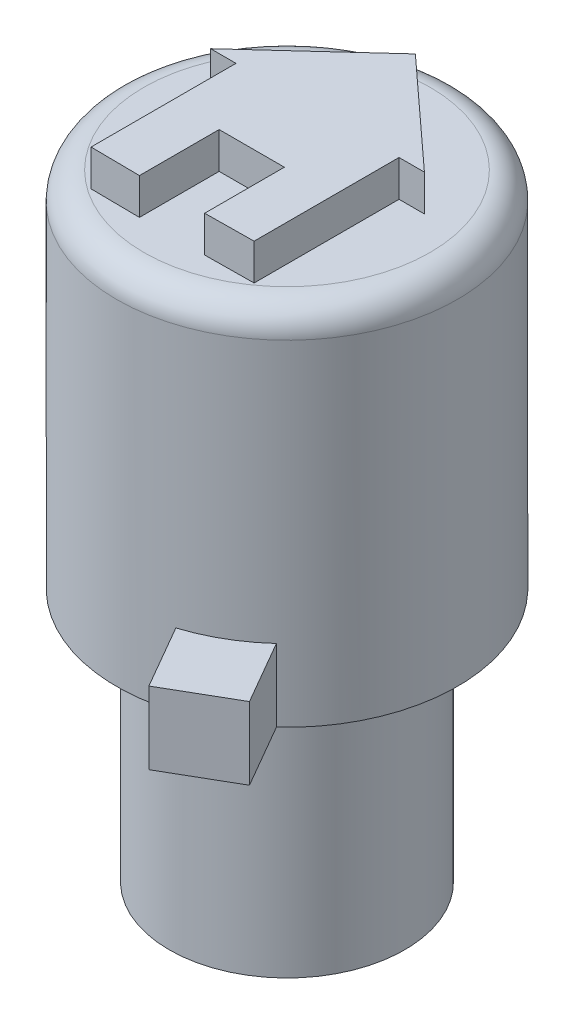
ISO-10303-21;
HEADER;
FILE_DESCRIPTION(('STEP AP214'),'2;1');
FILE_NAME('part.step','',(''),(''),'','','');
FILE_SCHEMA(('AUTOMOTIVE_DESIGN { 1 0 10303 214 1 1 1 1 }'));
ENDSEC;
DATA;
#1=APPLICATION_CONTEXT('core data for automotive mechanical design processes');
#2=APPLICATION_PROTOCOL_DEFINITION('international standard','automotive_design',2000,#1);
#3=PRODUCT_CONTEXT('',#1,'mechanical');
#4=PRODUCT('Part','Part','',(#3));
#5=PRODUCT_RELATED_PRODUCT_CATEGORY('part','',(#4));
#6=PRODUCT_DEFINITION_FORMATION('','',#4);
#7=PRODUCT_DEFINITION_CONTEXT('part definition',#1,'design');
#8=PRODUCT_DEFINITION('design','',#6,#7);
#9=PRODUCT_DEFINITION_SHAPE('','',#8);
#10=(LENGTH_UNIT() NAMED_UNIT(*) SI_UNIT(.MILLI.,.METRE.));
#11=(NAMED_UNIT(*) PLANE_ANGLE_UNIT() SI_UNIT($,.RADIAN.));
#12=(NAMED_UNIT(*) SI_UNIT($,.STERADIAN.) SOLID_ANGLE_UNIT());
#13=UNCERTAINTY_MEASURE_WITH_UNIT(LENGTH_MEASURE(1.E-05),#10,'distance_accuracy_value','');
#14=(GEOMETRIC_REPRESENTATION_CONTEXT(3) GLOBAL_UNCERTAINTY_ASSIGNED_CONTEXT((#13)) GLOBAL_UNIT_ASSIGNED_CONTEXT((#10,
#11,#12)) REPRESENTATION_CONTEXT('',''));
#15=CARTESIAN_POINT('',(0.,0.,0.));
#16=DIRECTION('',(0.,0.,1.));
#17=DIRECTION('',(1.,0.,0.));
#18=AXIS2_PLACEMENT_3D('',#15,#16,#17);
#19=CARTESIAN_POINT('',(0.,7.018,0.));
#20=DIRECTION('',(0.,-1.,0.));
#21=DIRECTION('',(0.,0.,-1.));
#22=AXIS2_PLACEMENT_3D('',#19,#20,#21);
#23=CYLINDRICAL_SURFACE('',#22,3.25);
#24=CARTESIAN_POINT('',(0.,7.018,0.));
#25=DIRECTION('',(0.,1.,0.));
#26=DIRECTION('',(0.,0.,1.));
#27=AXIS2_PLACEMENT_3D('',#24,#25,#26);
#28=CIRCLE('',#27,3.25);
#29=CARTESIAN_POINT('',(0.,7.018,3.25));
#30=VERTEX_POINT('',#29);
#31=EDGE_CURVE('E407',#30,#30,#28,.T.);
#32=ORIENTED_EDGE('',*,*,#31,.F.);
#33=EDGE_LOOP('',(#32));
#34=FACE_BOUND('',#33,.T.);
#35=CARTESIAN_POINT('',(0.,0.,0.));
#36=DIRECTION('',(0.,1.,0.));
#37=DIRECTION('',(0.,0.,1.));
#38=AXIS2_PLACEMENT_3D('',#35,#36,#37);
#39=CIRCLE('',#38,3.25);
#40=CARTESIAN_POINT('',(0.,0.,3.25));
#41=VERTEX_POINT('',#40);
#42=EDGE_CURVE('E411',#41,#41,#39,.T.);
#43=ORIENTED_EDGE('',*,*,#42,.T.);
#44=EDGE_LOOP('',(#43));
#45=FACE_BOUND('',#44,.T.);
#46=ADVANCED_FACE('F63',(#34,#45),#23,.T.);
#47=CARTESIAN_POINT('',(0.,0.,0.));
#48=DIRECTION('',(0.,1.,0.));
#49=DIRECTION('',(0.,0.,1.));
#50=AXIS2_PLACEMENT_3D('',#47,#48,#49);
#51=PLANE('',#50);
#52=ORIENTED_EDGE('',*,*,#42,.F.);
#53=EDGE_LOOP('',(#52));
#54=FACE_BOUND('',#53,.T.);
#55=ADVANCED_FACE('F439',(#54),#51,.F.);
#56=CARTESIAN_POINT('',(0.,17.018,0.));
#57=DIRECTION('',(0.,-1.,0.));
#58=DIRECTION('',(0.,0.,-1.));
#59=AXIS2_PLACEMENT_3D('',#56,#57,#58);
#60=CYLINDRICAL_SURFACE('',#59,4.7);
#61=CARTESIAN_POINT('',(0.,7.018,0.));
#62=DIRECTION('',(0.,1.,0.));
#63=DIRECTION('',(0.,0.,1.));
#64=AXIS2_PLACEMENT_3D('',#61,#62,#63);
#65=CIRCLE('',#64,4.7);
#66=CARTESIAN_POINT('',(3.17431768862556,7.018,3.46607951606406));
#67=VERTEX_POINT('',#66);
#68=CARTESIAN_POINT('',(-0.770430624962343,7.018,-4.63642498614182));
#69=VERTEX_POINT('',#68);
#70=EDGE_CURVE('E406',#67,#69,#65,.T.);
#71=ORIENTED_EDGE('',*,*,#70,.T.);
#72=DIRECTION('',(0.,-1.,0.));
#73=VECTOR('',#72,1.);
#74=CARTESIAN_POINT('',(-0.770430624962343,9.018,-4.63642498614182));
#75=LINE('',#74,#73);
#76=CARTESIAN_POINT('',(-0.770430624962343,9.018,-4.63642498614182));
#77=VERTEX_POINT('',#76);
#78=EDGE_CURVE('E79',#77,#69,#75,.T.);
#79=ORIENTED_EDGE('',*,*,#78,.F.);
#80=CARTESIAN_POINT('',(0.,9.018,0.));
#81=DIRECTION('',(0.,1.,0.));
#82=DIRECTION('',(0.,0.,-1.));
#83=AXIS2_PLACEMENT_3D('',#80,#81,#82);
#84=CIRCLE('',#83,4.7);
#85=CARTESIAN_POINT('',(-3.63004650825856,9.018,-2.98542498614181));
#86=VERTEX_POINT('',#85);
#87=EDGE_CURVE('E83',#77,#86,#84,.T.);
#88=ORIENTED_EDGE('',*,*,#87,.T.);
#89=DIRECTION('',(0.,-1.,0.));
#90=VECTOR('',#89,1.);
#91=CARTESIAN_POINT('',(-3.63004650825856,9.018,-2.98542498614181));
#92=LINE('',#91,#90);
#93=CARTESIAN_POINT('',(-3.63004650825856,7.018,-2.98542498614181));
#94=VERTEX_POINT('',#93);
#95=EDGE_CURVE('E207',#86,#94,#92,.T.);
#96=ORIENTED_EDGE('',*,*,#95,.T.);
#97=CARTESIAN_POINT('',(1.41455406813558,7.018,4.48207951606406));
#98=VERTEX_POINT('',#97);
#99=EDGE_CURVE('E403',#94,#98,#65,.T.);
#100=ORIENTED_EDGE('',*,*,#99,.T.);
#101=DIRECTION('',(0.,-1.,0.));
#102=VECTOR('',#101,1.);
#103=CARTESIAN_POINT('',(1.41455406813558,9.018,4.48207951606406));
#104=LINE('',#103,#102);
#105=CARTESIAN_POINT('',(1.41455406813558,9.018,4.48207951606406));
#106=VERTEX_POINT('',#105);
#107=EDGE_CURVE('E253',#106,#98,#104,.T.);
#108=ORIENTED_EDGE('',*,*,#107,.F.);
#109=CARTESIAN_POINT('',(0.,9.018,0.));
#110=DIRECTION('',(0.,1.,0.));
#111=DIRECTION('',(0.,0.,-1.));
#112=AXIS2_PLACEMENT_3D('',#109,#110,#111);
#113=CIRCLE('',#112,4.7);
#114=CARTESIAN_POINT('',(3.17431768862556,9.018,3.46607951606406));
#115=VERTEX_POINT('',#114);
#116=EDGE_CURVE('E262',#106,#115,#113,.T.);
#117=ORIENTED_EDGE('',*,*,#116,.T.);
#118=DIRECTION('',(0.,-1.,0.));
#119=VECTOR('',#118,1.);
#120=CARTESIAN_POINT('',(3.17431768862556,9.018,3.46607951606406));
#121=LINE('',#120,#119);
#122=EDGE_CURVE('E242',#115,#67,#121,.T.);
#123=ORIENTED_EDGE('',*,*,#122,.T.);
#124=EDGE_LOOP('',(#71,#79,#88,#96,#100,#108,#117,#123));
#125=FACE_BOUND('',#124,.T.);
#126=CARTESIAN_POINT('',(0.,16.268,0.));
#127=DIRECTION('',(0.,1.,0.));
#128=DIRECTION('',(0.,0.,1.));
#129=AXIS2_PLACEMENT_3D('',#126,#127,#128);
#130=CIRCLE('',#129,4.7);
#131=CARTESIAN_POINT('',(0.,16.268,4.7));
#132=VERTEX_POINT('',#131);
#133=EDGE_CURVE('E12',#132,#132,#130,.F.);
#134=ORIENTED_EDGE('',*,*,#133,.T.);
#135=EDGE_LOOP('',(#134));
#136=FACE_BOUND('',#135,.T.);
#137=ADVANCED_FACE('F444',(#125,#136),#60,.T.);
#138=CARTESIAN_POINT('',(0.,17.018,0.));
#139=DIRECTION('',(0.,1.,0.));
#140=DIRECTION('',(0.,0.,1.));
#141=AXIS2_PLACEMENT_3D('',#138,#139,#140);
#142=PLANE('',#141);
#143=CARTESIAN_POINT('',(0.,17.018,0.));
#144=DIRECTION('',(0.,1.,0.));
#145=DIRECTION('',(0.,0.,1.));
#146=AXIS2_PLACEMENT_3D('',#143,#144,#145);
#147=CIRCLE('',#146,3.95);
#148=CARTESIAN_POINT('',(0.,17.018,3.95));
#149=VERTEX_POINT('',#148);
#150=EDGE_CURVE('E72',#149,#149,#147,.T.);
#151=ORIENTED_EDGE('',*,*,#150,.T.);
#152=EDGE_LOOP('',(#151));
#153=FACE_BOUND('',#152,.T.);
#154=DIRECTION('',(-0.737672912354375,0.,-0.675158258765021));
#155=VECTOR('',#154,1.);
#156=CARTESIAN_POINT('',(2.95,17.018,-0.842487973796764));
#157=LINE('',#156,#155);
#158=CARTESIAN_POINT('',(2.95,17.018,-0.842487973796764));
#159=VERTEX_POINT('',#158);
#160=CARTESIAN_POINT('',(0.,17.018,-3.54248797379676));
#161=VERTEX_POINT('',#160);
#162=EDGE_CURVE('E237',#159,#161,#157,.T.);
#163=ORIENTED_EDGE('',*,*,#162,.F.);
#164=DIRECTION('',(1.,0.,0.));
#165=VECTOR('',#164,1.);
#166=CARTESIAN_POINT('',(2.25,17.018,-0.842487973796764));
#167=LINE('',#166,#165);
#168=CARTESIAN_POINT('',(2.25,17.018,-0.842487973796764));
#169=VERTEX_POINT('',#168);
#170=EDGE_CURVE('E287',#169,#159,#167,.T.);
#171=ORIENTED_EDGE('',*,*,#170,.F.);
#172=DIRECTION('',(0.,0.,-1.));
#173=VECTOR('',#172,1.);
#174=CARTESIAN_POINT('',(2.25,17.018,3.15751202620324));
#175=LINE('',#174,#173);
#176=CARTESIAN_POINT('',(2.25,17.018,3.15751202620324));
#177=VERTEX_POINT('',#176);
#178=EDGE_CURVE('E353',#177,#169,#175,.T.);
#179=ORIENTED_EDGE('',*,*,#178,.F.);
#180=DIRECTION('',(0.99993946534493,0.,-0.0110029834906805));
#181=VECTOR('',#180,1.);
#182=CARTESIAN_POINT('',(0.9,17.018,3.17236695315353));
#183=LINE('',#182,#181);
#184=CARTESIAN_POINT('',(0.9,17.018,3.17236695315353));
#185=VERTEX_POINT('',#184);
#186=EDGE_CURVE('E349',#185,#177,#183,.T.);
#187=ORIENTED_EDGE('',*,*,#186,.F.);
#188=DIRECTION('',(0.,0.,1.));
#189=VECTOR('',#188,1.);
#190=CARTESIAN_POINT('',(0.9,17.018,0.972366953153534));
#191=LINE('',#190,#189);
#192=CARTESIAN_POINT('',(0.9,17.018,0.972366953153534));
#193=VERTEX_POINT('',#192);
#194=EDGE_CURVE('E345',#193,#185,#191,.T.);
#195=ORIENTED_EDGE('',*,*,#194,.F.);
#196=DIRECTION('',(1.,0.,0.));
#197=VECTOR('',#196,1.);
#198=CARTESIAN_POINT('',(-0.9,17.018,0.972366953153534));
#199=LINE('',#198,#197);
#200=CARTESIAN_POINT('',(-0.9,17.018,0.972366953153534));
#201=VERTEX_POINT('',#200);
#202=EDGE_CURVE('E341',#201,#193,#199,.T.);
#203=ORIENTED_EDGE('',*,*,#202,.F.);
#204=DIRECTION('',(0.,0.,-1.));
#205=VECTOR('',#204,1.);
#206=CARTESIAN_POINT('',(-0.9,17.018,3.17236695315353));
#207=LINE('',#206,#205);
#208=CARTESIAN_POINT('',(-0.9,17.018,3.17236695315353));
#209=VERTEX_POINT('',#208);
#210=EDGE_CURVE('E337',#209,#201,#207,.T.);
#211=ORIENTED_EDGE('',*,*,#210,.F.);
#212=DIRECTION('',(0.99993946534493,0.,0.0110029834906805));
#213=VECTOR('',#212,1.);
#214=CARTESIAN_POINT('',(-2.25,17.018,3.15751202620324));
#215=LINE('',#214,#213);
#216=CARTESIAN_POINT('',(-2.25,17.018,3.15751202620324));
#217=VERTEX_POINT('',#216);
#218=EDGE_CURVE('E333',#217,#209,#215,.T.);
#219=ORIENTED_EDGE('',*,*,#218,.F.);
#220=DIRECTION('',(0.,0.,1.));
#221=VECTOR('',#220,1.);
#222=CARTESIAN_POINT('',(-2.25,17.018,-0.842487973796764));
#223=LINE('',#222,#221);
#224=CARTESIAN_POINT('',(-2.25,17.018,-0.842487973796764));
#225=VERTEX_POINT('',#224);
#226=EDGE_CURVE('E329',#225,#217,#223,.T.);
#227=ORIENTED_EDGE('',*,*,#226,.F.);
#228=DIRECTION('',(1.,0.,0.));
#229=VECTOR('',#228,1.);
#230=CARTESIAN_POINT('',(-2.95,17.018,-0.842487973796764));
#231=LINE('',#230,#229);
#232=CARTESIAN_POINT('',(-2.95,17.018,-0.842487973796764));
#233=VERTEX_POINT('',#232);
#234=EDGE_CURVE('E325',#233,#225,#231,.T.);
#235=ORIENTED_EDGE('',*,*,#234,.F.);
#236=DIRECTION('',(-0.737672912354375,0.,0.675158258765021));
#237=VECTOR('',#236,1.);
#238=CARTESIAN_POINT('',(0.,17.018,-3.54248797379676));
#239=LINE('',#238,#237);
#240=EDGE_CURVE('E321',#161,#233,#239,.T.);
#241=ORIENTED_EDGE('',*,*,#240,.F.);
#242=EDGE_LOOP('',(#163,#171,#179,#187,#195,#203,#211,#219,#227,#235,#241));
#243=FACE_BOUND('',#242,.T.);
#244=ADVANCED_FACE('F418',(#153,#243),#142,.T.);
#245=CARTESIAN_POINT('',(0.,7.018,0.));
#246=DIRECTION('',(0.,1.,0.));
#247=DIRECTION('',(0.,0.,1.));
#248=AXIS2_PLACEMENT_3D('',#245,#246,#247);
#249=PLANE('',#248);
#250=ORIENTED_EDGE('',*,*,#31,.T.);
#251=EDGE_LOOP('',(#250));
#252=FACE_BOUND('',#251,.T.);
#253=ORIENTED_EDGE('',*,*,#70,.F.);
#254=DIRECTION('',(0.500000000000001,0.,0.866025403784438));
#255=VECTOR('',#254,1.);
#256=CARTESIAN_POINT('',(3.17431768862556,7.018,3.46607951606406));
#257=LINE('',#256,#255);
#258=CARTESIAN_POINT('',(4.19031768862556,7.018,5.22584313655404));
#259=VERTEX_POINT('',#258);
#260=EDGE_CURVE('E229',#67,#259,#257,.T.);
#261=ORIENTED_EDGE('',*,*,#260,.T.);
#262=DIRECTION('',(-0.866025403784438,0.,0.500000000000001));
#263=VECTOR('',#262,1.);
#264=CARTESIAN_POINT('',(4.19031768862556,7.018,5.22584313655404));
#265=LINE('',#264,#263);
#266=CARTESIAN_POINT('',(2.43055406813558,7.018,6.24184313655404));
#267=VERTEX_POINT('',#266);
#268=EDGE_CURVE('E261',#259,#267,#265,.T.);
#269=ORIENTED_EDGE('',*,*,#268,.T.);
#270=DIRECTION('',(-0.500000000000001,0.,-0.866025403784438));
#271=VECTOR('',#270,1.);
#272=CARTESIAN_POINT('',(2.43055406813558,7.018,6.24184313655404));
#273=LINE('',#272,#271);
#274=EDGE_CURVE('E257',#267,#98,#273,.T.);
#275=ORIENTED_EDGE('',*,*,#274,.T.);
#276=ORIENTED_EDGE('',*,*,#99,.F.);
#277=DIRECTION('',(-0.500000000000001,0.,-0.866025403784438));
#278=VECTOR('',#277,1.);
#279=CARTESIAN_POINT('',(-4.64604650825856,7.018,-4.74518860663179));
#280=LINE('',#279,#278);
#281=CARTESIAN_POINT('',(-4.64604650825856,7.018,-4.74518860663179));
#282=VERTEX_POINT('',#281);
#283=EDGE_CURVE('E226',#94,#282,#280,.T.);
#284=ORIENTED_EDGE('',*,*,#283,.T.);
#285=DIRECTION('',(0.866025403784438,0.,-0.500000000000001));
#286=VECTOR('',#285,1.);
#287=CARTESIAN_POINT('',(-1.78643062496234,7.018,-6.39618860663179));
#288=LINE('',#287,#286);
#289=CARTESIAN_POINT('',(-1.78643062496234,7.018,-6.39618860663179));
#290=VERTEX_POINT('',#289);
#291=EDGE_CURVE('E200',#282,#290,#288,.T.);
#292=ORIENTED_EDGE('',*,*,#291,.T.);
#293=DIRECTION('',(0.500000000000001,0.,0.866025403784438));
#294=VECTOR('',#293,1.);
#295=CARTESIAN_POINT('',(-0.770430624962343,7.018,-4.63642498614182));
#296=LINE('',#295,#294);
#297=EDGE_CURVE('E221',#290,#69,#296,.T.);
#298=ORIENTED_EDGE('',*,*,#297,.T.);
#299=EDGE_LOOP('',(#253,#261,#269,#275,#276,#284,#292,#298));
#300=FACE_BOUND('',#299,.T.);
#301=ADVANCED_FACE('F451',(#252,#300),#249,.F.);
#302=CARTESIAN_POINT('',(2.95,18.018,-0.842487973796764));
#303=DIRECTION('',(-0.675158258765021,0.,0.737672912354375));
#304=DIRECTION('',(0.737672912354375,0.,0.675158258765021));
#305=AXIS2_PLACEMENT_3D('',#302,#303,#304);
#306=PLANE('',#305);
#307=ORIENTED_EDGE('',*,*,#162,.T.);
#308=DIRECTION('',(0.,-1.,0.));
#309=VECTOR('',#308,1.);
#310=CARTESIAN_POINT('',(0.,18.018,-3.54248797379676));
#311=LINE('',#310,#309);
#312=CARTESIAN_POINT('',(0.,18.018,-3.54248797379676));
#313=VERTEX_POINT('',#312);
#314=EDGE_CURVE('E399',#313,#161,#311,.T.);
#315=ORIENTED_EDGE('',*,*,#314,.F.);
#316=DIRECTION('',(-0.737672912354375,0.,-0.675158258765021));
#317=VECTOR('',#316,1.);
#318=CARTESIAN_POINT('',(2.95,18.018,-0.842487973796764));
#319=LINE('',#318,#317);
#320=CARTESIAN_POINT('',(2.95,18.018,-0.842487973796764));
#321=VERTEX_POINT('',#320);
#322=EDGE_CURVE('E282',#321,#313,#319,.T.);
#323=ORIENTED_EDGE('',*,*,#322,.F.);
#324=DIRECTION('',(0.,-1.,0.));
#325=VECTOR('',#324,1.);
#326=CARTESIAN_POINT('',(2.95,18.018,-0.842487973796764));
#327=LINE('',#326,#325);
#328=EDGE_CURVE('E317',#321,#159,#327,.T.);
#329=ORIENTED_EDGE('',*,*,#328,.T.);
#330=EDGE_LOOP('',(#307,#315,#323,#329));
#331=FACE_BOUND('',#330,.T.);
#332=ADVANCED_FACE('F454',(#331),#306,.F.);
#333=CARTESIAN_POINT('',(0.,18.018,-3.54248797379676));
#334=DIRECTION('',(0.675158258765021,0.,0.737672912354375));
#335=DIRECTION('',(0.737672912354375,0.,-0.675158258765021));
#336=AXIS2_PLACEMENT_3D('',#333,#334,#335);
#337=PLANE('',#336);
#338=ORIENTED_EDGE('',*,*,#240,.T.);
#339=DIRECTION('',(0.,-1.,0.));
#340=VECTOR('',#339,1.);
#341=CARTESIAN_POINT('',(-2.95,18.018,-0.842487973796764));
#342=LINE('',#341,#340);
#343=CARTESIAN_POINT('',(-2.95,18.018,-0.842487973796764));
#344=VERTEX_POINT('',#343);
#345=EDGE_CURVE('E395',#344,#233,#342,.T.);
#346=ORIENTED_EDGE('',*,*,#345,.F.);
#347=DIRECTION('',(-0.737672912354375,0.,0.675158258765021));
#348=VECTOR('',#347,1.);
#349=CARTESIAN_POINT('',(0.,18.018,-3.54248797379676));
#350=LINE('',#349,#348);
#351=EDGE_CURVE('E286',#313,#344,#350,.T.);
#352=ORIENTED_EDGE('',*,*,#351,.F.);
#353=ORIENTED_EDGE('',*,*,#314,.T.);
#354=EDGE_LOOP('',(#338,#346,#352,#353));
#355=FACE_BOUND('',#354,.T.);
#356=ADVANCED_FACE('F459',(#355),#337,.F.);
#357=CARTESIAN_POINT('',(-2.95,18.018,-0.842487973796764));
#358=DIRECTION('',(0.,0.,-1.));
#359=DIRECTION('',(-1.,0.,0.));
#360=AXIS2_PLACEMENT_3D('',#357,#358,#359);
#361=PLANE('',#360);
#362=ORIENTED_EDGE('',*,*,#234,.T.);
#363=DIRECTION('',(0.,-1.,0.));
#364=VECTOR('',#363,1.);
#365=CARTESIAN_POINT('',(-2.25,18.018,-0.842487973796764));
#366=LINE('',#365,#364);
#367=CARTESIAN_POINT('',(-2.25,18.018,-0.842487973796764));
#368=VERTEX_POINT('',#367);
#369=EDGE_CURVE('E391',#368,#225,#366,.T.);
#370=ORIENTED_EDGE('',*,*,#369,.F.);
#371=DIRECTION('',(1.,0.,0.));
#372=VECTOR('',#371,1.);
#373=CARTESIAN_POINT('',(-2.95,18.018,-0.842487973796764));
#374=LINE('',#373,#372);
#375=EDGE_CURVE('E290',#344,#368,#374,.T.);
#376=ORIENTED_EDGE('',*,*,#375,.F.);
#377=ORIENTED_EDGE('',*,*,#345,.T.);
#378=EDGE_LOOP('',(#362,#370,#376,#377));
#379=FACE_BOUND('',#378,.T.);
#380=ADVANCED_FACE('F463',(#379),#361,.F.);
#381=CARTESIAN_POINT('',(-2.25,18.018,-0.842487973796764));
#382=DIRECTION('',(1.,0.,0.));
#383=DIRECTION('',(0.,0.,-1.));
#384=AXIS2_PLACEMENT_3D('',#381,#382,#383);
#385=PLANE('',#384);
#386=ORIENTED_EDGE('',*,*,#226,.T.);
#387=DIRECTION('',(0.,-1.,0.));
#388=VECTOR('',#387,1.);
#389=CARTESIAN_POINT('',(-2.25,18.018,3.15751202620324));
#390=LINE('',#389,#388);
#391=CARTESIAN_POINT('',(-2.25,18.018,3.15751202620324));
#392=VERTEX_POINT('',#391);
#393=EDGE_CURVE('E387',#392,#217,#390,.T.);
#394=ORIENTED_EDGE('',*,*,#393,.F.);
#395=DIRECTION('',(0.,0.,1.));
#396=VECTOR('',#395,1.);
#397=CARTESIAN_POINT('',(-2.25,18.018,-0.842487973796764));
#398=LINE('',#397,#396);
#399=EDGE_CURVE('E293',#368,#392,#398,.T.);
#400=ORIENTED_EDGE('',*,*,#399,.F.);
#401=ORIENTED_EDGE('',*,*,#369,.T.);
#402=EDGE_LOOP('',(#386,#394,#400,#401));
#403=FACE_BOUND('',#402,.T.);
#404=ADVANCED_FACE('F467',(#403),#385,.F.);
#405=CARTESIAN_POINT('',(-2.25,18.018,3.15751202620324));
#406=DIRECTION('',(0.0110029834906805,0.,-0.99993946534493));
#407=DIRECTION('',(-0.99993946534493,0.,-0.0110029834906805));
#408=AXIS2_PLACEMENT_3D('',#405,#406,#407);
#409=PLANE('',#408);
#410=ORIENTED_EDGE('',*,*,#218,.T.);
#411=DIRECTION('',(0.,-1.,0.));
#412=VECTOR('',#411,1.);
#413=CARTESIAN_POINT('',(-0.9,18.018,3.17236695315353));
#414=LINE('',#413,#412);
#415=CARTESIAN_POINT('',(-0.9,18.018,3.17236695315353));
#416=VERTEX_POINT('',#415);
#417=EDGE_CURVE('E383',#416,#209,#414,.T.);
#418=ORIENTED_EDGE('',*,*,#417,.F.);
#419=DIRECTION('',(0.99993946534493,0.,0.0110029834906805));
#420=VECTOR('',#419,1.);
#421=CARTESIAN_POINT('',(-2.25,18.018,3.15751202620324));
#422=LINE('',#421,#420);
#423=EDGE_CURVE('E296',#392,#416,#422,.T.);
#424=ORIENTED_EDGE('',*,*,#423,.F.);
#425=ORIENTED_EDGE('',*,*,#393,.T.);
#426=EDGE_LOOP('',(#410,#418,#424,#425));
#427=FACE_BOUND('',#426,.T.);
#428=ADVANCED_FACE('F471',(#427),#409,.F.);
#429=CARTESIAN_POINT('',(-0.9,18.018,3.17236695315353));
#430=DIRECTION('',(-1.,0.,0.));
#431=DIRECTION('',(0.,0.,1.));
#432=AXIS2_PLACEMENT_3D('',#429,#430,#431);
#433=PLANE('',#432);
#434=ORIENTED_EDGE('',*,*,#210,.T.);
#435=DIRECTION('',(0.,-1.,0.));
#436=VECTOR('',#435,1.);
#437=CARTESIAN_POINT('',(-0.9,18.018,0.972366953153534));
#438=LINE('',#437,#436);
#439=CARTESIAN_POINT('',(-0.9,18.018,0.972366953153534));
#440=VERTEX_POINT('',#439);
#441=EDGE_CURVE('E379',#440,#201,#438,.T.);
#442=ORIENTED_EDGE('',*,*,#441,.F.);
#443=DIRECTION('',(0.,0.,-1.));
#444=VECTOR('',#443,1.);
#445=CARTESIAN_POINT('',(-0.9,18.018,3.17236695315353));
#446=LINE('',#445,#444);
#447=EDGE_CURVE('E299',#416,#440,#446,.T.);
#448=ORIENTED_EDGE('',*,*,#447,.F.);
#449=ORIENTED_EDGE('',*,*,#417,.T.);
#450=EDGE_LOOP('',(#434,#442,#448,#449));
#451=FACE_BOUND('',#450,.T.);
#452=ADVANCED_FACE('F475',(#451),#433,.F.);
#453=CARTESIAN_POINT('',(-0.9,18.018,0.972366953153534));
#454=DIRECTION('',(0.,0.,-1.));
#455=DIRECTION('',(-1.,0.,0.));
#456=AXIS2_PLACEMENT_3D('',#453,#454,#455);
#457=PLANE('',#456);
#458=ORIENTED_EDGE('',*,*,#202,.T.);
#459=DIRECTION('',(0.,-1.,0.));
#460=VECTOR('',#459,1.);
#461=CARTESIAN_POINT('',(0.9,18.018,0.972366953153534));
#462=LINE('',#461,#460);
#463=CARTESIAN_POINT('',(0.9,18.018,0.972366953153534));
#464=VERTEX_POINT('',#463);
#465=EDGE_CURVE('E375',#464,#193,#462,.T.);
#466=ORIENTED_EDGE('',*,*,#465,.F.);
#467=DIRECTION('',(1.,0.,0.));
#468=VECTOR('',#467,1.);
#469=CARTESIAN_POINT('',(-0.9,18.018,0.972366953153534));
#470=LINE('',#469,#468);
#471=EDGE_CURVE('E302',#440,#464,#470,.T.);
#472=ORIENTED_EDGE('',*,*,#471,.F.);
#473=ORIENTED_EDGE('',*,*,#441,.T.);
#474=EDGE_LOOP('',(#458,#466,#472,#473));
#475=FACE_BOUND('',#474,.T.);
#476=ADVANCED_FACE('F479',(#475),#457,.F.);
#477=CARTESIAN_POINT('',(0.9,18.018,0.972366953153534));
#478=DIRECTION('',(1.,0.,0.));
#479=DIRECTION('',(0.,0.,-1.));
#480=AXIS2_PLACEMENT_3D('',#477,#478,#479);
#481=PLANE('',#480);
#482=ORIENTED_EDGE('',*,*,#194,.T.);
#483=DIRECTION('',(0.,-1.,0.));
#484=VECTOR('',#483,1.);
#485=CARTESIAN_POINT('',(0.9,18.018,3.17236695315353));
#486=LINE('',#485,#484);
#487=CARTESIAN_POINT('',(0.9,18.018,3.17236695315353));
#488=VERTEX_POINT('',#487);
#489=EDGE_CURVE('E371',#488,#185,#486,.T.);
#490=ORIENTED_EDGE('',*,*,#489,.F.);
#491=DIRECTION('',(0.,0.,1.));
#492=VECTOR('',#491,1.);
#493=CARTESIAN_POINT('',(0.9,18.018,0.972366953153534));
#494=LINE('',#493,#492);
#495=EDGE_CURVE('E305',#464,#488,#494,.T.);
#496=ORIENTED_EDGE('',*,*,#495,.F.);
#497=ORIENTED_EDGE('',*,*,#465,.T.);
#498=EDGE_LOOP('',(#482,#490,#496,#497));
#499=FACE_BOUND('',#498,.T.);
#500=ADVANCED_FACE('F483',(#499),#481,.F.);
#501=CARTESIAN_POINT('',(0.9,18.018,3.17236695315353));
#502=DIRECTION('',(-0.0110029834906805,0.,-0.99993946534493));
#503=DIRECTION('',(-0.99993946534493,0.,0.0110029834906805));
#504=AXIS2_PLACEMENT_3D('',#501,#502,#503);
#505=PLANE('',#504);
#506=ORIENTED_EDGE('',*,*,#186,.T.);
#507=DIRECTION('',(0.,-1.,0.));
#508=VECTOR('',#507,1.);
#509=CARTESIAN_POINT('',(2.25,18.018,3.15751202620324));
#510=LINE('',#509,#508);
#511=CARTESIAN_POINT('',(2.25,18.018,3.15751202620324));
#512=VERTEX_POINT('',#511);
#513=EDGE_CURVE('E367',#512,#177,#510,.T.);
#514=ORIENTED_EDGE('',*,*,#513,.F.);
#515=DIRECTION('',(0.99993946534493,0.,-0.0110029834906805));
#516=VECTOR('',#515,1.);
#517=CARTESIAN_POINT('',(0.9,18.018,3.17236695315353));
#518=LINE('',#517,#516);
#519=EDGE_CURVE('E308',#488,#512,#518,.T.);
#520=ORIENTED_EDGE('',*,*,#519,.F.);
#521=ORIENTED_EDGE('',*,*,#489,.T.);
#522=EDGE_LOOP('',(#506,#514,#520,#521));
#523=FACE_BOUND('',#522,.T.);
#524=ADVANCED_FACE('F487',(#523),#505,.F.);
#525=CARTESIAN_POINT('',(2.25,18.018,3.15751202620324));
#526=DIRECTION('',(-1.,0.,0.));
#527=DIRECTION('',(0.,0.,1.));
#528=AXIS2_PLACEMENT_3D('',#525,#526,#527);
#529=PLANE('',#528);
#530=ORIENTED_EDGE('',*,*,#178,.T.);
#531=DIRECTION('',(0.,-1.,0.));
#532=VECTOR('',#531,1.);
#533=CARTESIAN_POINT('',(2.25,18.018,-0.842487973796764));
#534=LINE('',#533,#532);
#535=CARTESIAN_POINT('',(2.25,18.018,-0.842487973796764));
#536=VERTEX_POINT('',#535);
#537=EDGE_CURVE('E363',#536,#169,#534,.T.);
#538=ORIENTED_EDGE('',*,*,#537,.F.);
#539=DIRECTION('',(0.,0.,-1.));
#540=VECTOR('',#539,1.);
#541=CARTESIAN_POINT('',(2.25,18.018,3.15751202620324));
#542=LINE('',#541,#540);
#543=EDGE_CURVE('E311',#512,#536,#542,.T.);
#544=ORIENTED_EDGE('',*,*,#543,.F.);
#545=ORIENTED_EDGE('',*,*,#513,.T.);
#546=EDGE_LOOP('',(#530,#538,#544,#545));
#547=FACE_BOUND('',#546,.T.);
#548=ADVANCED_FACE('F491',(#547),#529,.F.);
#549=CARTESIAN_POINT('',(2.25,18.018,-0.842487973796764));
#550=DIRECTION('',(0.,0.,-1.));
#551=DIRECTION('',(-1.,0.,0.));
#552=AXIS2_PLACEMENT_3D('',#549,#550,#551);
#553=PLANE('',#552);
#554=ORIENTED_EDGE('',*,*,#170,.T.);
#555=ORIENTED_EDGE('',*,*,#328,.F.);
#556=DIRECTION('',(1.,0.,0.));
#557=VECTOR('',#556,1.);
#558=CARTESIAN_POINT('',(2.25,18.018,-0.842487973796764));
#559=LINE('',#558,#557);
#560=EDGE_CURVE('E314',#536,#321,#559,.T.);
#561=ORIENTED_EDGE('',*,*,#560,.F.);
#562=ORIENTED_EDGE('',*,*,#537,.T.);
#563=EDGE_LOOP('',(#554,#555,#561,#562));
#564=FACE_BOUND('',#563,.T.);
#565=ADVANCED_FACE('F434',(#564),#553,.F.);
#566=CARTESIAN_POINT('',(0.,18.018,0.));
#567=DIRECTION('',(0.,1.,0.));
#568=DIRECTION('',(0.,0.,1.));
#569=AXIS2_PLACEMENT_3D('',#566,#567,#568);
#570=PLANE('',#569);
#571=ORIENTED_EDGE('',*,*,#322,.T.);
#572=ORIENTED_EDGE('',*,*,#351,.T.);
#573=ORIENTED_EDGE('',*,*,#375,.T.);
#574=ORIENTED_EDGE('',*,*,#399,.T.);
#575=ORIENTED_EDGE('',*,*,#423,.T.);
#576=ORIENTED_EDGE('',*,*,#447,.T.);
#577=ORIENTED_EDGE('',*,*,#471,.T.);
#578=ORIENTED_EDGE('',*,*,#495,.T.);
#579=ORIENTED_EDGE('',*,*,#519,.T.);
#580=ORIENTED_EDGE('',*,*,#543,.T.);
#581=ORIENTED_EDGE('',*,*,#560,.T.);
#582=EDGE_LOOP('',(#571,#572,#573,#574,#575,#576,#577,#578,#579,#580,#581));
#583=FACE_BOUND('',#582,.T.);
#584=ADVANCED_FACE('F423',(#583),#570,.T.);
#585=CARTESIAN_POINT('',(0.,16.268,0.));
#586=DIRECTION('',(0.,1.,0.));
#587=DIRECTION('',(0.,0.,1.));
#588=AXIS2_PLACEMENT_3D('',#585,#586,#587);
#589=TOROIDAL_SURFACE('',#588,3.95,0.75);
#590=ORIENTED_EDGE('',*,*,#133,.F.);
#591=EDGE_LOOP('',(#590));
#592=FACE_BOUND('',#591,.T.);
#593=ORIENTED_EDGE('',*,*,#150,.F.);
#594=EDGE_LOOP('',(#593));
#595=FACE_BOUND('',#594,.T.);
#596=ADVANCED_FACE('F65',(#592,#595),#589,.T.);
#597=CARTESIAN_POINT('',(2.43055406813558,9.018,6.24184313655404));
#598=DIRECTION('',(-0.866025403784438,0.,0.500000000000001));
#599=DIRECTION('',(0.500000000000001,0.,0.866025403784438));
#600=AXIS2_PLACEMENT_3D('',#597,#598,#599);
#601=PLANE('',#600);
#602=ORIENTED_EDGE('',*,*,#274,.F.);
#603=DIRECTION('',(0.,-1.,0.));
#604=VECTOR('',#603,1.);
#605=CARTESIAN_POINT('',(2.43055406813558,9.018,6.24184313655404));
#606=LINE('',#605,#604);
#607=CARTESIAN_POINT('',(2.43055406813558,9.018,6.24184313655404));
#608=VERTEX_POINT('',#607);
#609=EDGE_CURVE('E250',#608,#267,#606,.T.);
#610=ORIENTED_EDGE('',*,*,#609,.F.);
#611=DIRECTION('',(-0.500000000000001,0.,-0.866025403784438));
#612=VECTOR('',#611,1.);
#613=CARTESIAN_POINT('',(2.43055406813558,9.018,6.24184313655404));
#614=LINE('',#613,#612);
#615=EDGE_CURVE('E246',#608,#106,#614,.T.);
#616=ORIENTED_EDGE('',*,*,#615,.T.);
#617=ORIENTED_EDGE('',*,*,#107,.T.);
#618=EDGE_LOOP('',(#602,#610,#616,#617));
#619=FACE_BOUND('',#618,.T.);
#620=ADVANCED_FACE('F422',(#619),#601,.T.);
#621=CARTESIAN_POINT('',(4.19031768862556,9.018,5.22584313655404));
#622=DIRECTION('',(0.500000000000001,0.,0.866025403784438));
#623=DIRECTION('',(0.866025403784438,0.,-0.500000000000001));
#624=AXIS2_PLACEMENT_3D('',#621,#622,#623);
#625=PLANE('',#624);
#626=ORIENTED_EDGE('',*,*,#268,.F.);
#627=DIRECTION('',(0.,-1.,0.));
#628=VECTOR('',#627,1.);
#629=CARTESIAN_POINT('',(4.19031768862556,9.018,5.22584313655404));
#630=LINE('',#629,#628);
#631=CARTESIAN_POINT('',(4.19031768862556,9.018,5.22584313655404));
#632=VERTEX_POINT('',#631);
#633=EDGE_CURVE('E247',#632,#259,#630,.T.);
#634=ORIENTED_EDGE('',*,*,#633,.F.);
#635=DIRECTION('',(-0.866025403784438,0.,0.500000000000001));
#636=VECTOR('',#635,1.);
#637=CARTESIAN_POINT('',(4.19031768862556,9.018,5.22584313655404));
#638=LINE('',#637,#636);
#639=EDGE_CURVE('E272',#632,#608,#638,.T.);
#640=ORIENTED_EDGE('',*,*,#639,.T.);
#641=ORIENTED_EDGE('',*,*,#609,.T.);
#642=EDGE_LOOP('',(#626,#634,#640,#641));
#643=FACE_BOUND('',#642,.T.);
#644=ADVANCED_FACE('F430',(#643),#625,.T.);
#645=CARTESIAN_POINT('',(3.17431768862556,9.018,3.46607951606406));
#646=DIRECTION('',(0.866025403784438,0.,-0.500000000000001));
#647=DIRECTION('',(-0.500000000000001,0.,-0.866025403784438));
#648=AXIS2_PLACEMENT_3D('',#645,#646,#647);
#649=PLANE('',#648);
#650=ORIENTED_EDGE('',*,*,#260,.F.);
#651=ORIENTED_EDGE('',*,*,#122,.F.);
#652=DIRECTION('',(0.500000000000001,0.,0.866025403784438));
#653=VECTOR('',#652,1.);
#654=CARTESIAN_POINT('',(3.17431768862556,9.018,3.46607951606406));
#655=LINE('',#654,#653);
#656=EDGE_CURVE('E276',#115,#632,#655,.T.);
#657=ORIENTED_EDGE('',*,*,#656,.T.);
#658=ORIENTED_EDGE('',*,*,#633,.T.);
#659=EDGE_LOOP('',(#650,#651,#657,#658));
#660=FACE_BOUND('',#659,.T.);
#661=ADVANCED_FACE('F502',(#660),#649,.T.);
#662=CARTESIAN_POINT('',(0.,9.018,0.));
#663=DIRECTION('',(0.,-1.,0.));
#664=DIRECTION('',(0.,0.,-1.));
#665=AXIS2_PLACEMENT_3D('',#662,#663,#664);
#666=PLANE('',#665);
#667=ORIENTED_EDGE('',*,*,#116,.F.);
#668=ORIENTED_EDGE('',*,*,#615,.F.);
#669=ORIENTED_EDGE('',*,*,#639,.F.);
#670=ORIENTED_EDGE('',*,*,#656,.F.);
#671=EDGE_LOOP('',(#667,#668,#669,#670));
#672=FACE_BOUND('',#671,.T.);
#673=ADVANCED_FACE('F499',(#672),#666,.F.);
#674=CARTESIAN_POINT('',(-0.770430624962343,9.018,-4.63642498614182));
#675=DIRECTION('',(0.866025403784438,0.,-0.500000000000001));
#676=DIRECTION('',(-0.500000000000001,0.,-0.866025403784438));
#677=AXIS2_PLACEMENT_3D('',#674,#675,#676);
#678=PLANE('',#677);
#679=ORIENTED_EDGE('',*,*,#297,.F.);
#680=DIRECTION('',(0.,-1.,0.));
#681=VECTOR('',#680,1.);
#682=CARTESIAN_POINT('',(-1.78643062496234,9.018,-6.39618860663179));
#683=LINE('',#682,#681);
#684=CARTESIAN_POINT('',(-1.78643062496234,9.018,-6.39618860663179));
#685=VERTEX_POINT('',#684);
#686=EDGE_CURVE('E206',#685,#290,#683,.T.);
#687=ORIENTED_EDGE('',*,*,#686,.F.);
#688=DIRECTION('',(0.500000000000001,0.,0.866025403784438));
#689=VECTOR('',#688,1.);
#690=CARTESIAN_POINT('',(-0.770430624962343,9.018,-4.63642498614182));
#691=LINE('',#690,#689);
#692=EDGE_CURVE('E214',#685,#77,#691,.T.);
#693=ORIENTED_EDGE('',*,*,#692,.T.);
#694=ORIENTED_EDGE('',*,*,#78,.T.);
#695=EDGE_LOOP('',(#679,#687,#693,#694));
#696=FACE_BOUND('',#695,.T.);
#697=ADVANCED_FACE('F501',(#696),#678,.T.);
#698=CARTESIAN_POINT('',(-1.78643062496234,9.018,-6.39618860663179));
#699=DIRECTION('',(-0.500000000000001,0.,-0.866025403784438));
#700=DIRECTION('',(-0.866025403784438,0.,0.500000000000001));
#701=AXIS2_PLACEMENT_3D('',#698,#699,#700);
#702=PLANE('',#701);
#703=ORIENTED_EDGE('',*,*,#291,.F.);
#704=DIRECTION('',(0.,-1.,0.));
#705=VECTOR('',#704,1.);
#706=CARTESIAN_POINT('',(-4.64604650825856,9.018,-4.74518860663179));
#707=LINE('',#706,#705);
#708=CARTESIAN_POINT('',(-4.64604650825856,9.018,-4.74518860663179));
#709=VERTEX_POINT('',#708);
#710=EDGE_CURVE('E194',#709,#282,#707,.T.);
#711=ORIENTED_EDGE('',*,*,#710,.F.);
#712=DIRECTION('',(0.866025403784438,0.,-0.500000000000001));
#713=VECTOR('',#712,1.);
#714=CARTESIAN_POINT('',(-1.78643062496234,9.018,-6.39618860663179));
#715=LINE('',#714,#713);
#716=EDGE_CURVE('E197',#709,#685,#715,.T.);
#717=ORIENTED_EDGE('',*,*,#716,.T.);
#718=ORIENTED_EDGE('',*,*,#686,.T.);
#719=EDGE_LOOP('',(#703,#711,#717,#718));
#720=FACE_BOUND('',#719,.T.);
#721=ADVANCED_FACE('F196',(#720),#702,.T.);
#722=CARTESIAN_POINT('',(-4.64604650825856,9.018,-4.74518860663179));
#723=DIRECTION('',(-0.866025403784438,0.,0.500000000000001));
#724=DIRECTION('',(0.500000000000001,0.,0.866025403784438));
#725=AXIS2_PLACEMENT_3D('',#722,#723,#724);
#726=PLANE('',#725);
#727=ORIENTED_EDGE('',*,*,#283,.F.);
#728=ORIENTED_EDGE('',*,*,#95,.F.);
#729=DIRECTION('',(-0.500000000000001,0.,-0.866025403784438));
#730=VECTOR('',#729,1.);
#731=CARTESIAN_POINT('',(-4.64604650825856,9.018,-4.74518860663179));
#732=LINE('',#731,#730);
#733=EDGE_CURVE('E212',#86,#709,#732,.T.);
#734=ORIENTED_EDGE('',*,*,#733,.T.);
#735=ORIENTED_EDGE('',*,*,#710,.T.);
#736=EDGE_LOOP('',(#727,#728,#734,#735));
#737=FACE_BOUND('',#736,.T.);
#738=ADVANCED_FACE('F217',(#737),#726,.T.);
#739=CARTESIAN_POINT('',(0.,9.018,0.));
#740=DIRECTION('',(0.,-1.,0.));
#741=DIRECTION('',(0.,0.,-1.));
#742=AXIS2_PLACEMENT_3D('',#739,#740,#741);
#743=PLANE('',#742);
#744=ORIENTED_EDGE('',*,*,#87,.F.);
#745=ORIENTED_EDGE('',*,*,#692,.F.);
#746=ORIENTED_EDGE('',*,*,#716,.F.);
#747=ORIENTED_EDGE('',*,*,#733,.F.);
#748=EDGE_LOOP('',(#744,#745,#746,#747));
#749=FACE_BOUND('',#748,.T.);
#750=ADVANCED_FACE('F211',(#749),#743,.F.);
#751=CLOSED_SHELL('',(#46,#55,#137,#244,#301,#332,#356,#380,#404,#428,#452,#476,#500,#524,#548,
#565,#584,#596,#620,#644,#661,#673,#697,#721,#738,#750));
#752=MANIFOLD_SOLID_BREP('B2',#751);
#753=ADVANCED_BREP_SHAPE_REPRESENTATION('',(#18,#752),#14);
#754=SHAPE_DEFINITION_REPRESENTATION(#9,#753);
ENDSEC;
END-ISO-10303-21;
